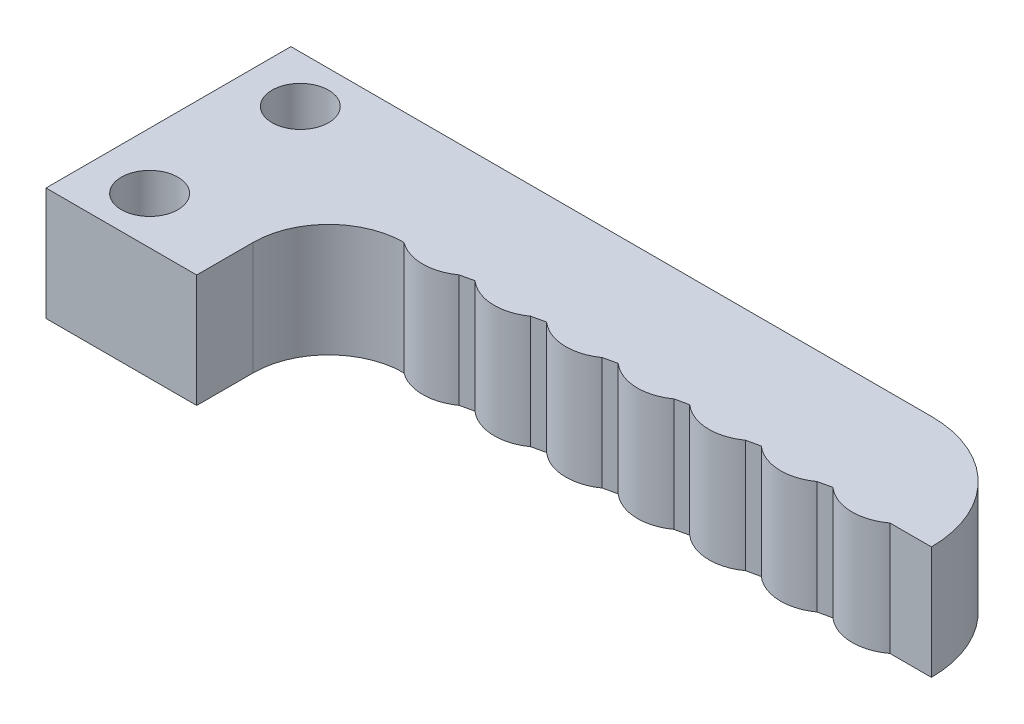
ISO-10303-21;
HEADER;
FILE_DESCRIPTION(('STEP AP214'),'2;1');
FILE_NAME('part.step','',(''),(''),'','','');
FILE_SCHEMA(('AUTOMOTIVE_DESIGN { 1 0 10303 214 1 1 1 1 }'));
ENDSEC;
DATA;
#1=APPLICATION_CONTEXT('core data for automotive mechanical design processes');
#2=APPLICATION_PROTOCOL_DEFINITION('international standard','automotive_design',2000,#1);
#3=PRODUCT_CONTEXT('',#1,'mechanical');
#4=PRODUCT('Part','Part','',(#3));
#5=PRODUCT_RELATED_PRODUCT_CATEGORY('part','',(#4));
#6=PRODUCT_DEFINITION_FORMATION('','',#4);
#7=PRODUCT_DEFINITION_CONTEXT('part definition',#1,'design');
#8=PRODUCT_DEFINITION('design','',#6,#7);
#9=PRODUCT_DEFINITION_SHAPE('','',#8);
#10=(LENGTH_UNIT() NAMED_UNIT(*) SI_UNIT(.MILLI.,.METRE.));
#11=(NAMED_UNIT(*) PLANE_ANGLE_UNIT() SI_UNIT($,.RADIAN.));
#12=(NAMED_UNIT(*) SI_UNIT($,.STERADIAN.) SOLID_ANGLE_UNIT());
#13=UNCERTAINTY_MEASURE_WITH_UNIT(LENGTH_MEASURE(1.E-05),#10,'distance_accuracy_value','');
#14=(GEOMETRIC_REPRESENTATION_CONTEXT(3) GLOBAL_UNCERTAINTY_ASSIGNED_CONTEXT((#13)) GLOBAL_UNIT_ASSIGNED_CONTEXT((#10,
#11,#12)) REPRESENTATION_CONTEXT('',''));
#15=CARTESIAN_POINT('',(0.,0.,0.));
#16=DIRECTION('',(0.,0.,1.));
#17=DIRECTION('',(1.,0.,0.));
#18=AXIS2_PLACEMENT_3D('',#15,#16,#17);
#19=CARTESIAN_POINT('',(14.,6.,-0.500000000000001));
#20=DIRECTION('',(0.,-1.,0.));
#21=DIRECTION('',(0.,0.,-1.));
#22=AXIS2_PLACEMENT_3D('',#19,#20,#21);
#23=CYLINDRICAL_SURFACE('',#22,6.);
#24=CARTESIAN_POINT('',(14.,0.,-0.500000000000001));
#25=DIRECTION('',(0.,-1.,0.));
#26=DIRECTION('',(0.,0.,-1.));
#27=AXIS2_PLACEMENT_3D('',#24,#25,#26);
#28=CIRCLE('',#27,6.);
#29=CARTESIAN_POINT('',(14.,0.,-6.5));
#30=VERTEX_POINT('',#29);
#31=CARTESIAN_POINT('',(20.,0.,-0.500000000000003));
#32=VERTEX_POINT('',#31);
#33=EDGE_CURVE('E236',#30,#32,#28,.T.);
#34=ORIENTED_EDGE('',*,*,#33,.F.);
#35=DIRECTION('',(0.,-1.,0.));
#36=VECTOR('',#35,1.);
#37=CARTESIAN_POINT('',(14.,6.,-6.5));
#38=LINE('',#37,#36);
#39=CARTESIAN_POINT('',(14.,6.,-6.5));
#40=VERTEX_POINT('',#39);
#41=EDGE_CURVE('E196',#40,#30,#38,.T.);
#42=ORIENTED_EDGE('',*,*,#41,.F.);
#43=CARTESIAN_POINT('',(14.,6.,-0.500000000000001));
#44=DIRECTION('',(0.,-1.,0.));
#45=DIRECTION('',(0.,0.,-1.));
#46=AXIS2_PLACEMENT_3D('',#43,#44,#45);
#47=CIRCLE('',#46,6.);
#48=CARTESIAN_POINT('',(20.,6.,-0.500000000000003));
#49=VERTEX_POINT('',#48);
#50=EDGE_CURVE('E191',#40,#49,#47,.T.);
#51=ORIENTED_EDGE('',*,*,#50,.T.);
#52=DIRECTION('',(0.,-1.,0.));
#53=VECTOR('',#52,1.);
#54=CARTESIAN_POINT('',(20.,6.,-0.500000000000003));
#55=LINE('',#54,#53);
#56=EDGE_CURVE('E174',#49,#32,#55,.T.);
#57=ORIENTED_EDGE('',*,*,#56,.T.);
#58=EDGE_LOOP('',(#34,#42,#51,#57));
#59=FACE_BOUND('',#58,.T.);
#60=ADVANCED_FACE('F35',(#59),#23,.T.);
#61=CARTESIAN_POINT('',(-20.,6.,-6.5));
#62=DIRECTION('',(0.,0.,-1.));
#63=DIRECTION('',(-1.,0.,0.));
#64=AXIS2_PLACEMENT_3D('',#61,#62,#63);
#65=PLANE('',#64);
#66=DIRECTION('',(1.,0.,0.));
#67=VECTOR('',#66,1.);
#68=CARTESIAN_POINT('',(-20.,0.,-6.5));
#69=LINE('',#68,#67);
#70=CARTESIAN_POINT('',(-20.,0.,-6.5));
#71=VERTEX_POINT('',#70);
#72=EDGE_CURVE('E197',#71,#30,#69,.T.);
#73=ORIENTED_EDGE('',*,*,#72,.F.);
#74=DIRECTION('',(0.,-1.,0.));
#75=VECTOR('',#74,1.);
#76=CARTESIAN_POINT('',(-20.,6.,-6.5));
#77=LINE('',#76,#75);
#78=CARTESIAN_POINT('',(-20.,6.,-6.5));
#79=VERTEX_POINT('',#78);
#80=EDGE_CURVE('E273',#79,#71,#77,.T.);
#81=ORIENTED_EDGE('',*,*,#80,.F.);
#82=DIRECTION('',(1.,0.,0.));
#83=VECTOR('',#82,1.);
#84=CARTESIAN_POINT('',(-20.,6.,-6.5));
#85=LINE('',#84,#83);
#86=EDGE_CURVE('E185',#79,#40,#85,.T.);
#87=ORIENTED_EDGE('',*,*,#86,.T.);
#88=ORIENTED_EDGE('',*,*,#41,.T.);
#89=EDGE_LOOP('',(#73,#81,#87,#88));
#90=FACE_BOUND('',#89,.T.);
#91=ADVANCED_FACE('F378',(#90),#65,.T.);
#92=CARTESIAN_POINT('',(-20.,6.,6.5));
#93=DIRECTION('',(-1.,0.,0.));
#94=DIRECTION('',(0.,0.,1.));
#95=AXIS2_PLACEMENT_3D('',#92,#93,#94);
#96=PLANE('',#95);
#97=DIRECTION('',(0.,0.,-1.));
#98=VECTOR('',#97,1.);
#99=CARTESIAN_POINT('',(-20.,0.,6.5));
#100=LINE('',#99,#98);
#101=CARTESIAN_POINT('',(-20.,0.,6.5));
#102=VERTEX_POINT('',#101);
#103=EDGE_CURVE('E200',#102,#71,#100,.T.);
#104=ORIENTED_EDGE('',*,*,#103,.F.);
#105=DIRECTION('',(0.,-1.,0.));
#106=VECTOR('',#105,1.);
#107=CARTESIAN_POINT('',(-20.,6.,6.5));
#108=LINE('',#107,#106);
#109=CARTESIAN_POINT('',(-20.,6.,6.5));
#110=VERTEX_POINT('',#109);
#111=EDGE_CURVE('E275',#110,#102,#108,.T.);
#112=ORIENTED_EDGE('',*,*,#111,.F.);
#113=DIRECTION('',(0.,0.,-1.));
#114=VECTOR('',#113,1.);
#115=CARTESIAN_POINT('',(-20.,6.,6.5));
#116=LINE('',#115,#114);
#117=EDGE_CURVE('E232',#110,#79,#116,.T.);
#118=ORIENTED_EDGE('',*,*,#117,.T.);
#119=ORIENTED_EDGE('',*,*,#80,.T.);
#120=EDGE_LOOP('',(#104,#112,#118,#119));
#121=FACE_BOUND('',#120,.T.);
#122=ADVANCED_FACE('F416',(#121),#96,.T.);
#123=CARTESIAN_POINT('',(-12.,6.,6.5));
#124=DIRECTION('',(0.,0.,1.));
#125=DIRECTION('',(1.,0.,0.));
#126=AXIS2_PLACEMENT_3D('',#123,#124,#125);
#127=PLANE('',#126);
#128=DIRECTION('',(-1.,0.,0.));
#129=VECTOR('',#128,1.);
#130=CARTESIAN_POINT('',(-12.,0.,6.5));
#131=LINE('',#130,#129);
#132=CARTESIAN_POINT('',(-12.,0.,6.5));
#133=VERTEX_POINT('',#132);
#134=EDGE_CURVE('E266',#133,#102,#131,.T.);
#135=ORIENTED_EDGE('',*,*,#134,.F.);
#136=DIRECTION('',(0.,-1.,0.));
#137=VECTOR('',#136,1.);
#138=CARTESIAN_POINT('',(-12.,6.,6.5));
#139=LINE('',#138,#137);
#140=CARTESIAN_POINT('',(-12.,6.,6.5));
#141=VERTEX_POINT('',#140);
#142=EDGE_CURVE('E277',#141,#133,#139,.T.);
#143=ORIENTED_EDGE('',*,*,#142,.F.);
#144=DIRECTION('',(-1.,0.,0.));
#145=VECTOR('',#144,1.);
#146=CARTESIAN_POINT('',(-12.,6.,6.5));
#147=LINE('',#146,#145);
#148=EDGE_CURVE('E229',#141,#110,#147,.T.);
#149=ORIENTED_EDGE('',*,*,#148,.T.);
#150=ORIENTED_EDGE('',*,*,#111,.T.);
#151=EDGE_LOOP('',(#135,#143,#149,#150));
#152=FACE_BOUND('',#151,.T.);
#153=ADVANCED_FACE('F385',(#152),#127,.T.);
#154=CARTESIAN_POINT('',(-12.,6.,3.5));
#155=DIRECTION('',(1.,0.,0.));
#156=DIRECTION('',(0.,0.,-1.));
#157=AXIS2_PLACEMENT_3D('',#154,#155,#156);
#158=PLANE('',#157);
#159=DIRECTION('',(0.,0.,1.));
#160=VECTOR('',#159,1.);
#161=CARTESIAN_POINT('',(-12.,0.,3.5));
#162=LINE('',#161,#160);
#163=CARTESIAN_POINT('',(-12.,0.,3.5));
#164=VERTEX_POINT('',#163);
#165=EDGE_CURVE('E263',#164,#133,#162,.T.);
#166=ORIENTED_EDGE('',*,*,#165,.F.);
#167=DIRECTION('',(0.,-1.,0.));
#168=VECTOR('',#167,1.);
#169=CARTESIAN_POINT('',(-12.,6.,3.5));
#170=LINE('',#169,#168);
#171=CARTESIAN_POINT('',(-12.,6.,3.5));
#172=VERTEX_POINT('',#171);
#173=EDGE_CURVE('E279',#172,#164,#170,.T.);
#174=ORIENTED_EDGE('',*,*,#173,.F.);
#175=DIRECTION('',(0.,0.,1.));
#176=VECTOR('',#175,1.);
#177=CARTESIAN_POINT('',(-12.,6.,3.5));
#178=LINE('',#177,#176);
#179=EDGE_CURVE('E226',#172,#141,#178,.T.);
#180=ORIENTED_EDGE('',*,*,#179,.T.);
#181=ORIENTED_EDGE('',*,*,#142,.T.);
#182=EDGE_LOOP('',(#166,#174,#180,#181));
#183=FACE_BOUND('',#182,.T.);
#184=ADVANCED_FACE('F388',(#183),#158,.T.);
#185=CARTESIAN_POINT('',(-8.,6.,3.5));
#186=DIRECTION('',(0.,-1.,0.));
#187=DIRECTION('',(0.,0.,-1.));
#188=AXIS2_PLACEMENT_3D('',#185,#186,#187);
#189=CYLINDRICAL_SURFACE('',#188,4.);
#190=CARTESIAN_POINT('',(-8.,0.,3.5));
#191=DIRECTION('',(0.,1.,0.));
#192=DIRECTION('',(0.,0.,1.));
#193=AXIS2_PLACEMENT_3D('',#190,#191,#192);
#194=CIRCLE('',#193,4.);
#195=CARTESIAN_POINT('',(-8.00000000000001,0.,-0.5));
#196=VERTEX_POINT('',#195);
#197=EDGE_CURVE('E260',#196,#164,#194,.T.);
#198=ORIENTED_EDGE('',*,*,#197,.F.);
#199=DIRECTION('',(0.,-1.,0.));
#200=VECTOR('',#199,1.);
#201=CARTESIAN_POINT('',(-8.00000000000001,6.,-0.5));
#202=LINE('',#201,#200);
#203=CARTESIAN_POINT('',(-8.00000000000001,6.,-0.5));
#204=VERTEX_POINT('',#203);
#205=EDGE_CURVE('E281',#204,#196,#202,.T.);
#206=ORIENTED_EDGE('',*,*,#205,.F.);
#207=CARTESIAN_POINT('',(-8.,6.,3.5));
#208=DIRECTION('',(0.,1.,0.));
#209=DIRECTION('',(0.,0.,1.));
#210=AXIS2_PLACEMENT_3D('',#207,#208,#209);
#211=CIRCLE('',#210,4.);
#212=EDGE_CURVE('E223',#204,#172,#211,.T.);
#213=ORIENTED_EDGE('',*,*,#212,.T.);
#214=ORIENTED_EDGE('',*,*,#173,.T.);
#215=EDGE_LOOP('',(#198,#206,#213,#214));
#216=FACE_BOUND('',#215,.T.);
#217=ADVANCED_FACE('F394',(#216),#189,.F.);
#218=CARTESIAN_POINT('',(-6.50000000000003,6.,-2.50000000000002));
#219=DIRECTION('',(0.,-1.,0.));
#220=DIRECTION('',(0.,0.,-1.));
#221=AXIS2_PLACEMENT_3D('',#218,#219,#220);
#222=CYLINDRICAL_SURFACE('',#221,2.50000000000001);
#223=CARTESIAN_POINT('',(-6.50000000000003,0.,-2.50000000000002));
#224=DIRECTION('',(0.,-1.,0.));
#225=DIRECTION('',(0.,0.,-1.));
#226=AXIS2_PLACEMENT_3D('',#223,#224,#225);
#227=CIRCLE('',#226,2.50000000000001);
#228=CARTESIAN_POINT('',(-5.0422733429896,0.,-0.468982276433528));
#229=VERTEX_POINT('',#228);
#230=EDGE_CURVE('E258',#229,#196,#227,.T.);
#231=ORIENTED_EDGE('',*,*,#230,.F.);
#232=DIRECTION('',(0.,-1.,0.));
#233=VECTOR('',#232,1.);
#234=CARTESIAN_POINT('',(-5.0422733429896,6.,-0.468982276433529));
#235=LINE('',#234,#233);
#236=CARTESIAN_POINT('',(-5.0422733429896,6.,-0.468982276433528));
#237=VERTEX_POINT('',#236);
#238=EDGE_CURVE('E307',#229,#237,#235,.F.);
#239=ORIENTED_EDGE('',*,*,#238,.T.);
#240=CARTESIAN_POINT('',(-6.50000000000003,6.,-2.50000000000002));
#241=DIRECTION('',(0.,-1.,0.));
#242=DIRECTION('',(0.,0.,-1.));
#243=AXIS2_PLACEMENT_3D('',#240,#241,#242);
#244=CIRCLE('',#243,2.50000000000001);
#245=EDGE_CURVE('E221',#237,#204,#244,.T.);
#246=ORIENTED_EDGE('',*,*,#245,.T.);
#247=ORIENTED_EDGE('',*,*,#205,.T.);
#248=EDGE_LOOP('',(#231,#239,#246,#247));
#249=FACE_BOUND('',#248,.T.);
#250=ADVANCED_FACE('F397',(#249),#222,.T.);
#251=CARTESIAN_POINT('',(-2.70000000000003,6.,-2.50000000000004));
#252=DIRECTION('',(0.,-1.,0.));
#253=DIRECTION('',(0.,0.,-1.));
#254=AXIS2_PLACEMENT_3D('',#251,#252,#253);
#255=CYLINDRICAL_SURFACE('',#254,2.5);
#256=CARTESIAN_POINT('',(-2.70000000000003,6.,-2.50000000000004));
#257=DIRECTION('',(0.,-1.,0.));
#258=DIRECTION('',(0.,0.,-1.));
#259=AXIS2_PLACEMENT_3D('',#256,#257,#258);
#260=CIRCLE('',#259,2.5);
#261=CARTESIAN_POINT('',(-1.2422733429896,6.,-0.468982276433551));
#262=VERTEX_POINT('',#261);
#263=CARTESIAN_POINT('',(-4.35164629120996,6.,-0.623283577965927));
#264=VERTEX_POINT('',#263);
#265=EDGE_CURVE('E218',#262,#264,#260,.T.);
#266=ORIENTED_EDGE('',*,*,#265,.T.);
#267=DIRECTION('',(0.,-1.,0.));
#268=VECTOR('',#267,1.);
#269=CARTESIAN_POINT('',(-4.35164629120996,6.,-0.623283577965928));
#270=LINE('',#269,#268);
#271=CARTESIAN_POINT('',(-4.35164629120996,0.,-0.62328357796593));
#272=VERTEX_POINT('',#271);
#273=EDGE_CURVE('E304',#264,#272,#270,.T.);
#274=ORIENTED_EDGE('',*,*,#273,.T.);
#275=CARTESIAN_POINT('',(-2.70000000000003,0.,-2.50000000000004));
#276=DIRECTION('',(0.,-1.,0.));
#277=DIRECTION('',(0.,0.,-1.));
#278=AXIS2_PLACEMENT_3D('',#275,#276,#277);
#279=CIRCLE('',#278,2.5);
#280=CARTESIAN_POINT('',(-1.2422733429896,0.,-0.468982276433551));
#281=VERTEX_POINT('',#280);
#282=EDGE_CURVE('E255',#281,#272,#279,.T.);
#283=ORIENTED_EDGE('',*,*,#282,.F.);
#284=DIRECTION('',(0.,-1.,0.));
#285=VECTOR('',#284,1.);
#286=CARTESIAN_POINT('',(-1.2422733429896,6.,-0.468982276433552));
#287=LINE('',#286,#285);
#288=EDGE_CURVE('E302',#281,#262,#287,.F.);
#289=ORIENTED_EDGE('',*,*,#288,.T.);
#290=EDGE_LOOP('',(#266,#274,#283,#289));
#291=FACE_BOUND('',#290,.T.);
#292=ADVANCED_FACE('F339',(#291),#255,.T.);
#293=CARTESIAN_POINT('',(1.09999999999997,6.,-2.50000000000006));
#294=DIRECTION('',(0.,-1.,0.));
#295=DIRECTION('',(0.,0.,-1.));
#296=AXIS2_PLACEMENT_3D('',#293,#294,#295);
#297=CYLINDRICAL_SURFACE('',#296,2.5);
#298=CARTESIAN_POINT('',(1.09999999999997,0.,-2.50000000000006));
#299=DIRECTION('',(0.,-1.,0.));
#300=DIRECTION('',(0.,0.,-1.));
#301=AXIS2_PLACEMENT_3D('',#298,#299,#300);
#302=CIRCLE('',#301,2.5);
#303=CARTESIAN_POINT('',(2.55772665701041,0.,-0.468982276433582));
#304=VERTEX_POINT('',#303);
#305=CARTESIAN_POINT('',(-0.551646291209957,0.,-0.623283577965954));
#306=VERTEX_POINT('',#305);
#307=EDGE_CURVE('E252',#304,#306,#302,.T.);
#308=ORIENTED_EDGE('',*,*,#307,.F.);
#309=DIRECTION('',(0.,-1.,0.));
#310=VECTOR('',#309,1.);
#311=CARTESIAN_POINT('',(2.55772665701041,6.,-0.468982276433583));
#312=LINE('',#311,#310);
#313=CARTESIAN_POINT('',(2.55772665701041,6.,-0.468982276433582));
#314=VERTEX_POINT('',#313);
#315=EDGE_CURVE('E300',#304,#314,#312,.F.);
#316=ORIENTED_EDGE('',*,*,#315,.T.);
#317=CARTESIAN_POINT('',(1.09999999999997,6.,-2.50000000000006));
#318=DIRECTION('',(0.,-1.,0.));
#319=DIRECTION('',(0.,0.,-1.));
#320=AXIS2_PLACEMENT_3D('',#317,#318,#319);
#321=CIRCLE('',#320,2.5);
#322=CARTESIAN_POINT('',(-0.551646291209955,6.,-0.623283577965952));
#323=VERTEX_POINT('',#322);
#324=EDGE_CURVE('E215',#314,#323,#321,.T.);
#325=ORIENTED_EDGE('',*,*,#324,.T.);
#326=DIRECTION('',(0.,-1.,0.));
#327=VECTOR('',#326,1.);
#328=CARTESIAN_POINT('',(-0.551646291209955,6.,-0.623283577965952));
#329=LINE('',#328,#327);
#330=EDGE_CURVE('E297',#323,#306,#329,.T.);
#331=ORIENTED_EDGE('',*,*,#330,.T.);
#332=EDGE_LOOP('',(#308,#316,#325,#331));
#333=FACE_BOUND('',#332,.T.);
#334=ADVANCED_FACE('F346',(#333),#297,.T.);
#335=CARTESIAN_POINT('',(4.89999999999997,6.,-2.50000000000009));
#336=DIRECTION('',(0.,-1.,0.));
#337=DIRECTION('',(0.,0.,-1.));
#338=AXIS2_PLACEMENT_3D('',#335,#336,#337);
#339=CYLINDRICAL_SURFACE('',#338,2.5);
#340=CARTESIAN_POINT('',(4.89999999999997,6.,-2.50000000000009));
#341=DIRECTION('',(0.,-1.,0.));
#342=DIRECTION('',(0.,0.,-1.));
#343=AXIS2_PLACEMENT_3D('',#340,#341,#342);
#344=CIRCLE('',#343,2.5);
#345=CARTESIAN_POINT('',(6.35772665701041,6.,-0.46898227643361));
#346=VERTEX_POINT('',#345);
#347=CARTESIAN_POINT('',(3.24835370879004,6.,-0.623283577965983));
#348=VERTEX_POINT('',#347);
#349=EDGE_CURVE('E212',#346,#348,#344,.T.);
#350=ORIENTED_EDGE('',*,*,#349,.T.);
#351=DIRECTION('',(0.,-1.,0.));
#352=VECTOR('',#351,1.);
#353=CARTESIAN_POINT('',(3.24835370879004,6.,-0.623283577965984));
#354=LINE('',#353,#352);
#355=CARTESIAN_POINT('',(3.24835370879003,0.,-0.623283577965985));
#356=VERTEX_POINT('',#355);
#357=EDGE_CURVE('E294',#348,#356,#354,.T.);
#358=ORIENTED_EDGE('',*,*,#357,.T.);
#359=CARTESIAN_POINT('',(4.89999999999997,0.,-2.50000000000009));
#360=DIRECTION('',(0.,-1.,0.));
#361=DIRECTION('',(0.,0.,-1.));
#362=AXIS2_PLACEMENT_3D('',#359,#360,#361);
#363=CIRCLE('',#362,2.5);
#364=CARTESIAN_POINT('',(6.35772665701041,0.,-0.46898227643361));
#365=VERTEX_POINT('',#364);
#366=EDGE_CURVE('E249',#365,#356,#363,.T.);
#367=ORIENTED_EDGE('',*,*,#366,.F.);
#368=DIRECTION('',(0.,-1.,0.));
#369=VECTOR('',#368,1.);
#370=CARTESIAN_POINT('',(6.35772665701041,6.,-0.468982276433611));
#371=LINE('',#370,#369);
#372=EDGE_CURVE('E292',#365,#346,#371,.F.);
#373=ORIENTED_EDGE('',*,*,#372,.T.);
#374=EDGE_LOOP('',(#350,#358,#367,#373));
#375=FACE_BOUND('',#374,.T.);
#376=ADVANCED_FACE('F352',(#375),#339,.T.);
#377=CARTESIAN_POINT('',(8.69999999999997,6.,-2.50000000000012));
#378=DIRECTION('',(0.,-1.,0.));
#379=DIRECTION('',(0.,0.,-1.));
#380=AXIS2_PLACEMENT_3D('',#377,#378,#379);
#381=CYLINDRICAL_SURFACE('',#380,2.5);
#382=CARTESIAN_POINT('',(8.69999999999997,0.,-2.50000000000012));
#383=DIRECTION('',(0.,-1.,0.));
#384=DIRECTION('',(0.,0.,-1.));
#385=AXIS2_PLACEMENT_3D('',#382,#383,#384);
#386=CIRCLE('',#385,2.5);
#387=CARTESIAN_POINT('',(10.1577266570104,0.,-0.468982276433635));
#388=VERTEX_POINT('',#387);
#389=CARTESIAN_POINT('',(7.04835370879004,0.,-0.623283577966012));
#390=VERTEX_POINT('',#389);
#391=EDGE_CURVE('E246',#388,#390,#386,.T.);
#392=ORIENTED_EDGE('',*,*,#391,.F.);
#393=DIRECTION('',(0.,-1.,0.));
#394=VECTOR('',#393,1.);
#395=CARTESIAN_POINT('',(10.1577266570104,6.,-0.468982276433635));
#396=LINE('',#395,#394);
#397=CARTESIAN_POINT('',(10.1577266570104,6.,-0.468982276433635));
#398=VERTEX_POINT('',#397);
#399=EDGE_CURVE('E58',#388,#398,#396,.F.);
#400=ORIENTED_EDGE('',*,*,#399,.T.);
#401=CARTESIAN_POINT('',(8.69999999999997,6.,-2.50000000000012));
#402=DIRECTION('',(0.,-1.,0.));
#403=DIRECTION('',(0.,0.,-1.));
#404=AXIS2_PLACEMENT_3D('',#401,#402,#403);
#405=CIRCLE('',#404,2.5);
#406=CARTESIAN_POINT('',(7.04835370879004,6.,-0.62328357796601));
#407=VERTEX_POINT('',#406);
#408=EDGE_CURVE('E210',#398,#407,#405,.T.);
#409=ORIENTED_EDGE('',*,*,#408,.T.);
#410=DIRECTION('',(0.,-1.,0.));
#411=VECTOR('',#410,1.);
#412=CARTESIAN_POINT('',(7.04835370879004,6.,-0.62328357796601));
#413=LINE('',#412,#411);
#414=EDGE_CURVE('E309',#407,#390,#413,.T.);
#415=ORIENTED_EDGE('',*,*,#414,.T.);
#416=EDGE_LOOP('',(#392,#400,#409,#415));
#417=FACE_BOUND('',#416,.T.);
#418=ADVANCED_FACE('F358',(#417),#381,.T.);
#419=CARTESIAN_POINT('',(12.5,6.,-2.50000000000015));
#420=DIRECTION('',(0.,-1.,0.));
#421=DIRECTION('',(0.,0.,-1.));
#422=AXIS2_PLACEMENT_3D('',#419,#420,#421);
#423=CYLINDRICAL_SURFACE('',#422,2.5);
#424=CARTESIAN_POINT('',(12.5,0.,-2.50000000000015));
#425=DIRECTION('',(0.,-1.,0.));
#426=DIRECTION('',(0.,0.,-1.));
#427=AXIS2_PLACEMENT_3D('',#424,#425,#426);
#428=CIRCLE('',#427,2.5);
#429=CARTESIAN_POINT('',(13.9577266570104,0.,-0.468982276433666));
#430=VERTEX_POINT('',#429);
#431=CARTESIAN_POINT('',(10.84835370879,0.,-0.623283577966035));
#432=VERTEX_POINT('',#431);
#433=EDGE_CURVE('E243',#430,#432,#428,.T.);
#434=ORIENTED_EDGE('',*,*,#433,.F.);
#435=DIRECTION('',(0.,-1.,0.));
#436=VECTOR('',#435,1.);
#437=CARTESIAN_POINT('',(13.9577266570104,6.,-0.468982276433666));
#438=LINE('',#437,#436);
#439=CARTESIAN_POINT('',(13.9577266570104,6.,-0.468982276433666));
#440=VERTEX_POINT('',#439);
#441=EDGE_CURVE('E290',#430,#440,#438,.F.);
#442=ORIENTED_EDGE('',*,*,#441,.T.);
#443=CARTESIAN_POINT('',(12.5,6.,-2.50000000000015));
#444=DIRECTION('',(0.,-1.,0.));
#445=DIRECTION('',(0.,0.,-1.));
#446=AXIS2_PLACEMENT_3D('',#443,#444,#445);
#447=CIRCLE('',#446,2.5);
#448=CARTESIAN_POINT('',(10.84835370879,6.,-0.623283577966034));
#449=VERTEX_POINT('',#448);
#450=EDGE_CURVE('E207',#440,#449,#447,.T.);
#451=ORIENTED_EDGE('',*,*,#450,.T.);
#452=DIRECTION('',(0.,-1.,0.));
#453=VECTOR('',#452,1.);
#454=CARTESIAN_POINT('',(10.84835370879,6.,-0.623283577966033));
#455=LINE('',#454,#453);
#456=EDGE_CURVE('E287',#449,#432,#455,.T.);
#457=ORIENTED_EDGE('',*,*,#456,.T.);
#458=EDGE_LOOP('',(#434,#442,#451,#457));
#459=FACE_BOUND('',#458,.T.);
#460=ADVANCED_FACE('F365',(#459),#423,.T.);
#461=CARTESIAN_POINT('',(16.3,6.,-2.50000000000018));
#462=DIRECTION('',(0.,-1.,0.));
#463=DIRECTION('',(0.,0.,-1.));
#464=AXIS2_PLACEMENT_3D('',#461,#462,#463);
#465=CYLINDRICAL_SURFACE('',#464,2.50000000000003);
#466=CARTESIAN_POINT('',(16.3,6.,-2.50000000000018));
#467=DIRECTION('',(0.,-1.,0.));
#468=DIRECTION('',(0.,0.,-1.));
#469=AXIS2_PLACEMENT_3D('',#466,#467,#468);
#470=CIRCLE('',#469,2.50000000000003);
#471=CARTESIAN_POINT('',(17.7999999999998,6.,-0.500000000000027));
#472=VERTEX_POINT('',#471);
#473=CARTESIAN_POINT('',(14.64835370879,6.,-0.623283577966059));
#474=VERTEX_POINT('',#473);
#475=EDGE_CURVE('E194',#472,#474,#470,.T.);
#476=ORIENTED_EDGE('',*,*,#475,.T.);
#477=DIRECTION('',(0.,-1.,0.));
#478=VECTOR('',#477,1.);
#479=CARTESIAN_POINT('',(14.64835370879,6.,-0.623283577966059));
#480=LINE('',#479,#478);
#481=CARTESIAN_POINT('',(14.64835370879,0.,-0.623283577966061));
#482=VERTEX_POINT('',#481);
#483=EDGE_CURVE('E272',#474,#482,#480,.T.);
#484=ORIENTED_EDGE('',*,*,#483,.T.);
#485=CARTESIAN_POINT('',(16.3,0.,-2.50000000000018));
#486=DIRECTION('',(0.,-1.,0.));
#487=DIRECTION('',(0.,0.,-1.));
#488=AXIS2_PLACEMENT_3D('',#485,#486,#487);
#489=CIRCLE('',#488,2.50000000000003);
#490=CARTESIAN_POINT('',(17.7999999999998,0.,-0.500000000000027));
#491=VERTEX_POINT('',#490);
#492=EDGE_CURVE('E240',#491,#482,#489,.T.);
#493=ORIENTED_EDGE('',*,*,#492,.F.);
#494=DIRECTION('',(0.,-1.,0.));
#495=VECTOR('',#494,1.);
#496=CARTESIAN_POINT('',(17.7999999999998,6.,-0.500000000000027));
#497=LINE('',#496,#495);
#498=EDGE_CURVE('E184',#472,#491,#497,.T.);
#499=ORIENTED_EDGE('',*,*,#498,.F.);
#500=EDGE_LOOP('',(#476,#484,#493,#499));
#501=FACE_BOUND('',#500,.T.);
#502=ADVANCED_FACE('F374',(#501),#465,.T.);
#503=CARTESIAN_POINT('',(20.,6.,-0.500000000000003));
#504=DIRECTION('',(0.,0.,1.));
#505=DIRECTION('',(1.,0.,0.));
#506=AXIS2_PLACEMENT_3D('',#503,#504,#505);
#507=PLANE('',#506);
#508=DIRECTION('',(-1.,0.,0.));
#509=VECTOR('',#508,1.);
#510=CARTESIAN_POINT('',(20.,0.,-0.500000000000003));
#511=LINE('',#510,#509);
#512=EDGE_CURVE('E179',#32,#491,#511,.T.);
#513=ORIENTED_EDGE('',*,*,#512,.F.);
#514=ORIENTED_EDGE('',*,*,#56,.F.);
#515=DIRECTION('',(-1.,0.,0.));
#516=VECTOR('',#515,1.);
#517=CARTESIAN_POINT('',(20.,6.,-0.500000000000003));
#518=LINE('',#517,#516);
#519=EDGE_CURVE('E177',#49,#472,#518,.T.);
#520=ORIENTED_EDGE('',*,*,#519,.T.);
#521=ORIENTED_EDGE('',*,*,#498,.T.);
#522=EDGE_LOOP('',(#513,#514,#520,#521));
#523=FACE_BOUND('',#522,.T.);
#524=ADVANCED_FACE('F176',(#523),#507,.T.);
#525=CARTESIAN_POINT('',(14.,6.,-0.500000000000001));
#526=DIRECTION('',(0.,-1.,0.));
#527=DIRECTION('',(0.,0.,-1.));
#528=AXIS2_PLACEMENT_3D('',#525,#526,#527);
#529=PLANE('',#528);
#530=CARTESIAN_POINT('',(-17.,6.,-4.));
#531=DIRECTION('',(0.,1.,0.));
#532=DIRECTION('',(0.,0.,1.));
#533=AXIS2_PLACEMENT_3D('',#530,#531,#532);
#534=CIRCLE('',#533,1.5);
#535=CARTESIAN_POINT('',(-17.,6.,-2.5));
#536=VERTEX_POINT('',#535);
#537=EDGE_CURVE('E623',#536,#536,#534,.T.);
#538=ORIENTED_EDGE('',*,*,#537,.F.);
#539=EDGE_LOOP('',(#538));
#540=FACE_BOUND('',#539,.T.);
#541=CARTESIAN_POINT('',(-17.,6.,4.));
#542=DIRECTION('',(0.,1.,0.));
#543=DIRECTION('',(0.,0.,1.));
#544=AXIS2_PLACEMENT_3D('',#541,#542,#543);
#545=CIRCLE('',#544,1.5);
#546=CARTESIAN_POINT('',(-17.,6.,5.5));
#547=VERTEX_POINT('',#546);
#548=EDGE_CURVE('E203',#547,#547,#545,.T.);
#549=ORIENTED_EDGE('',*,*,#548,.F.);
#550=EDGE_LOOP('',(#549));
#551=FACE_BOUND('',#550,.T.);
#552=ORIENTED_EDGE('',*,*,#50,.F.);
#553=ORIENTED_EDGE('',*,*,#86,.F.);
#554=ORIENTED_EDGE('',*,*,#117,.F.);
#555=ORIENTED_EDGE('',*,*,#148,.F.);
#556=ORIENTED_EDGE('',*,*,#179,.F.);
#557=ORIENTED_EDGE('',*,*,#212,.F.);
#558=ORIENTED_EDGE('',*,*,#245,.F.);
#559=DIRECTION('',(-0.9759384578967,0.,0.218046156577479));
#560=VECTOR('',#559,1.);
#561=CARTESIAN_POINT('',(13.1012523093638,6.,-4.52264570495199));
#562=LINE('',#561,#560);
#563=EDGE_CURVE('E323',#237,#264,#562,.F.);
#564=ORIENTED_EDGE('',*,*,#563,.T.);
#565=ORIENTED_EDGE('',*,*,#265,.F.);
#566=DIRECTION('',(-0.9759384578967,0.,0.218046156577479));
#567=VECTOR('',#566,1.);
#568=CARTESIAN_POINT('',(13.281919989677,6.,-3.71400711171001));
#569=LINE('',#568,#567);
#570=EDGE_CURVE('E11',#262,#323,#569,.F.);
#571=ORIENTED_EDGE('',*,*,#570,.T.);
#572=ORIENTED_EDGE('',*,*,#324,.F.);
#573=DIRECTION('',(-0.975938457896699,0.,0.218046156577484));
#574=VECTOR('',#573,1.);
#575=CARTESIAN_POINT('',(13.4625876699902,6.,-2.90536851846809));
#576=LINE('',#575,#574);
#577=EDGE_CURVE('E319',#314,#348,#576,.F.);
#578=ORIENTED_EDGE('',*,*,#577,.T.);
#579=ORIENTED_EDGE('',*,*,#349,.F.);
#580=DIRECTION('',(-0.9759384578967,0.,0.218046156577483));
#581=VECTOR('',#580,1.);
#582=CARTESIAN_POINT('',(13.6432553503034,6.,-2.09672992522609));
#583=LINE('',#582,#581);
#584=EDGE_CURVE('E51',#346,#407,#583,.F.);
#585=ORIENTED_EDGE('',*,*,#584,.T.);
#586=ORIENTED_EDGE('',*,*,#408,.F.);
#587=DIRECTION('',(-0.9759384578967,0.,0.218046156577481));
#588=VECTOR('',#587,1.);
#589=CARTESIAN_POINT('',(13.8239230306166,6.,-1.28809133198408));
#590=LINE('',#589,#588);
#591=EDGE_CURVE('E327',#398,#449,#590,.F.);
#592=ORIENTED_EDGE('',*,*,#591,.T.);
#593=ORIENTED_EDGE('',*,*,#450,.F.);
#594=DIRECTION('',(-0.975938457896699,0.,0.218046156577485));
#595=VECTOR('',#594,1.);
#596=CARTESIAN_POINT('',(14.0045907109298,6.,-0.479452738742103));
#597=LINE('',#596,#595);
#598=EDGE_CURVE('E315',#440,#474,#597,.F.);
#599=ORIENTED_EDGE('',*,*,#598,.T.);
#600=ORIENTED_EDGE('',*,*,#475,.F.);
#601=ORIENTED_EDGE('',*,*,#519,.F.);
#602=EDGE_LOOP('',(#552,#553,#554,#555,#556,#557,#558,#564,#565,#571,#572,#578,#579,#585,#586,
#592,#593,#599,#600,#601));
#603=FACE_BOUND('',#602,.T.);
#604=ADVANCED_FACE('F189',(#540,#551,#603),#529,.F.);
#605=CARTESIAN_POINT('',(14.,0.,-0.500000000000001));
#606=DIRECTION('',(0.,-1.,0.));
#607=DIRECTION('',(0.,0.,-1.));
#608=AXIS2_PLACEMENT_3D('',#605,#606,#607);
#609=PLANE('',#608);
#610=CARTESIAN_POINT('',(-17.,0.,-4.));
#611=DIRECTION('',(0.,1.,0.));
#612=DIRECTION('',(0.,0.,1.));
#613=AXIS2_PLACEMENT_3D('',#610,#611,#612);
#614=CIRCLE('',#613,1.5);
#615=CARTESIAN_POINT('',(-17.,0.,-2.5));
#616=VERTEX_POINT('',#615);
#617=EDGE_CURVE('E238',#616,#616,#614,.T.);
#618=ORIENTED_EDGE('',*,*,#617,.T.);
#619=EDGE_LOOP('',(#618));
#620=FACE_BOUND('',#619,.T.);
#621=CARTESIAN_POINT('',(-17.,0.,4.));
#622=DIRECTION('',(0.,1.,0.));
#623=DIRECTION('',(0.,0.,1.));
#624=AXIS2_PLACEMENT_3D('',#621,#622,#623);
#625=CIRCLE('',#624,1.5);
#626=CARTESIAN_POINT('',(-17.,0.,5.5));
#627=VERTEX_POINT('',#626);
#628=EDGE_CURVE('E622',#627,#627,#625,.T.);
#629=ORIENTED_EDGE('',*,*,#628,.T.);
#630=EDGE_LOOP('',(#629));
#631=FACE_BOUND('',#630,.T.);
#632=ORIENTED_EDGE('',*,*,#33,.T.);
#633=ORIENTED_EDGE('',*,*,#512,.T.);
#634=ORIENTED_EDGE('',*,*,#492,.T.);
#635=DIRECTION('',(0.975938457896699,0.,-0.218046156577485));
#636=VECTOR('',#635,1.);
#637=CARTESIAN_POINT('',(14.64835370879,0.,-0.623283577966061));
#638=LINE('',#637,#636);
#639=EDGE_CURVE('E313',#482,#430,#638,.F.);
#640=ORIENTED_EDGE('',*,*,#639,.T.);
#641=ORIENTED_EDGE('',*,*,#433,.T.);
#642=DIRECTION('',(0.9759384578967,0.,-0.218046156577481));
#643=VECTOR('',#642,1.);
#644=CARTESIAN_POINT('',(10.84835370879,0.,-0.623283577966036));
#645=LINE('',#644,#643);
#646=EDGE_CURVE('E325',#432,#388,#645,.F.);
#647=ORIENTED_EDGE('',*,*,#646,.T.);
#648=ORIENTED_EDGE('',*,*,#391,.T.);
#649=DIRECTION('',(0.9759384578967,0.,-0.218046156577483));
#650=VECTOR('',#649,1.);
#651=CARTESIAN_POINT('',(7.04835370879004,0.,-0.623283577966012));
#652=LINE('',#651,#650);
#653=EDGE_CURVE('E329',#390,#365,#652,.F.);
#654=ORIENTED_EDGE('',*,*,#653,.T.);
#655=ORIENTED_EDGE('',*,*,#366,.T.);
#656=DIRECTION('',(0.975938457896699,0.,-0.218046156577484));
#657=VECTOR('',#656,1.);
#658=CARTESIAN_POINT('',(3.24835370879004,0.,-0.623283577965985));
#659=LINE('',#658,#657);
#660=EDGE_CURVE('E317',#356,#304,#659,.F.);
#661=ORIENTED_EDGE('',*,*,#660,.T.);
#662=ORIENTED_EDGE('',*,*,#307,.T.);
#663=DIRECTION('',(0.9759384578967,0.,-0.218046156577479));
#664=VECTOR('',#663,1.);
#665=CARTESIAN_POINT('',(-0.551646291209957,0.,-0.623283577965953));
#666=LINE('',#665,#664);
#667=EDGE_CURVE('E44',#306,#281,#666,.F.);
#668=ORIENTED_EDGE('',*,*,#667,.T.);
#669=ORIENTED_EDGE('',*,*,#282,.T.);
#670=DIRECTION('',(0.9759384578967,0.,-0.218046156577479));
#671=VECTOR('',#670,1.);
#672=CARTESIAN_POINT('',(-4.35164629120996,0.,-0.62328357796593));
#673=LINE('',#672,#671);
#674=EDGE_CURVE('E321',#272,#229,#673,.F.);
#675=ORIENTED_EDGE('',*,*,#674,.T.);
#676=ORIENTED_EDGE('',*,*,#230,.T.);
#677=ORIENTED_EDGE('',*,*,#197,.T.);
#678=ORIENTED_EDGE('',*,*,#165,.T.);
#679=ORIENTED_EDGE('',*,*,#134,.T.);
#680=ORIENTED_EDGE('',*,*,#103,.T.);
#681=ORIENTED_EDGE('',*,*,#72,.T.);
#682=EDGE_LOOP('',(#632,#633,#634,#640,#641,#647,#648,#654,#655,#661,#662,#668,#669,#675,#676,
#677,#678,#679,#680,#681));
#683=FACE_BOUND('',#682,.T.);
#684=ADVANCED_FACE('F333',(#620,#631,#683),#609,.T.);
#685=CARTESIAN_POINT('',(14.64835370879,6.,-0.623283577966061));
#686=DIRECTION('',(0.218046156577485,0.,0.975938457896699));
#687=DIRECTION('',(0.,1.,0.));
#688=AXIS2_PLACEMENT_3D('',#685,#686,#687);
#689=PLANE('',#688);
#690=ORIENTED_EDGE('',*,*,#598,.F.);
#691=ORIENTED_EDGE('',*,*,#441,.F.);
#692=ORIENTED_EDGE('',*,*,#639,.F.);
#693=ORIENTED_EDGE('',*,*,#483,.F.);
#694=EDGE_LOOP('',(#690,#691,#692,#693));
#695=FACE_BOUND('',#694,.T.);
#696=ADVANCED_FACE('F371',(#695),#689,.T.);
#697=CARTESIAN_POINT('',(3.24835370879004,6.,-0.623283577965985));
#698=DIRECTION('',(0.218046156577484,0.,0.975938457896699));
#699=DIRECTION('',(0.,1.,0.));
#700=AXIS2_PLACEMENT_3D('',#697,#698,#699);
#701=PLANE('',#700);
#702=ORIENTED_EDGE('',*,*,#577,.F.);
#703=ORIENTED_EDGE('',*,*,#315,.F.);
#704=ORIENTED_EDGE('',*,*,#660,.F.);
#705=ORIENTED_EDGE('',*,*,#357,.F.);
#706=EDGE_LOOP('',(#702,#703,#704,#705));
#707=FACE_BOUND('',#706,.T.);
#708=ADVANCED_FACE('F349',(#707),#701,.T.);
#709=CARTESIAN_POINT('',(-4.35164629120996,6.,-0.62328357796593));
#710=DIRECTION('',(0.218046156577479,0.,0.9759384578967));
#711=DIRECTION('',(0.,1.,0.));
#712=AXIS2_PLACEMENT_3D('',#709,#710,#711);
#713=PLANE('',#712);
#714=ORIENTED_EDGE('',*,*,#563,.F.);
#715=ORIENTED_EDGE('',*,*,#238,.F.);
#716=ORIENTED_EDGE('',*,*,#674,.F.);
#717=ORIENTED_EDGE('',*,*,#273,.F.);
#718=EDGE_LOOP('',(#714,#715,#716,#717));
#719=FACE_BOUND('',#718,.T.);
#720=ADVANCED_FACE('F401',(#719),#713,.T.);
#721=CARTESIAN_POINT('',(10.84835370879,6.,-0.623283577966036));
#722=DIRECTION('',(0.218046156577481,0.,0.9759384578967));
#723=DIRECTION('',(0.,1.,0.));
#724=AXIS2_PLACEMENT_3D('',#721,#722,#723);
#725=PLANE('',#724);
#726=ORIENTED_EDGE('',*,*,#591,.F.);
#727=ORIENTED_EDGE('',*,*,#399,.F.);
#728=ORIENTED_EDGE('',*,*,#646,.F.);
#729=ORIENTED_EDGE('',*,*,#456,.F.);
#730=EDGE_LOOP('',(#726,#727,#728,#729));
#731=FACE_BOUND('',#730,.T.);
#732=ADVANCED_FACE('F363',(#731),#725,.T.);
#733=CARTESIAN_POINT('',(7.04835370879004,6.,-0.623283577966012));
#734=DIRECTION('',(0.218046156577483,0.,0.975938457896699));
#735=DIRECTION('',(0.,1.,0.));
#736=AXIS2_PLACEMENT_3D('',#733,#734,#735);
#737=PLANE('',#736);
#738=ORIENTED_EDGE('',*,*,#584,.F.);
#739=ORIENTED_EDGE('',*,*,#372,.F.);
#740=ORIENTED_EDGE('',*,*,#653,.F.);
#741=ORIENTED_EDGE('',*,*,#414,.F.);
#742=EDGE_LOOP('',(#738,#739,#740,#741));
#743=FACE_BOUND('',#742,.T.);
#744=ADVANCED_FACE('F356',(#743),#737,.T.);
#745=CARTESIAN_POINT('',(-0.551646291209957,6.,-0.623283577965953));
#746=DIRECTION('',(0.218046156577479,0.,0.9759384578967));
#747=DIRECTION('',(0.,1.,0.));
#748=AXIS2_PLACEMENT_3D('',#745,#746,#747);
#749=PLANE('',#748);
#750=ORIENTED_EDGE('',*,*,#570,.F.);
#751=ORIENTED_EDGE('',*,*,#288,.F.);
#752=ORIENTED_EDGE('',*,*,#667,.F.);
#753=ORIENTED_EDGE('',*,*,#330,.F.);
#754=EDGE_LOOP('',(#750,#751,#752,#753));
#755=FACE_BOUND('',#754,.T.);
#756=ADVANCED_FACE('F38',(#755),#749,.T.);
#757=CARTESIAN_POINT('',(-17.,0.,4.));
#758=DIRECTION('',(0.,1.,0.));
#759=DIRECTION('',(0.,0.,1.));
#760=AXIS2_PLACEMENT_3D('',#757,#758,#759);
#761=CYLINDRICAL_SURFACE('',#760,1.5);
#762=CARTESIAN_POINT('',(-17.,0.,5.5));
#763=CARTESIAN_POINT('',(-17.,0.0624999999999999,5.5));
#764=CARTESIAN_POINT('',(-17.,0.125,5.5));
#765=CARTESIAN_POINT('',(-17.,0.25,5.5));
#766=CARTESIAN_POINT('',(-17.,0.3125,5.5));
#767=CARTESIAN_POINT('',(-17.,0.4375,5.5));
#768=CARTESIAN_POINT('',(-17.,0.5,5.5));
#769=CARTESIAN_POINT('',(-17.,0.625,5.5));
#770=CARTESIAN_POINT('',(-17.,0.6875,5.5));
#771=CARTESIAN_POINT('',(-17.,0.8125,5.5));
#772=CARTESIAN_POINT('',(-17.,0.875,5.5));
#773=CARTESIAN_POINT('',(-17.,1.,5.5));
#774=CARTESIAN_POINT('',(-17.,1.0625,5.5));
#775=CARTESIAN_POINT('',(-17.,1.1875,5.5));
#776=CARTESIAN_POINT('',(-17.,1.25,5.5));
#777=CARTESIAN_POINT('',(-17.,1.375,5.5));
#778=CARTESIAN_POINT('',(-17.,1.4375,5.5));
#779=CARTESIAN_POINT('',(-17.,1.5625,5.5));
#780=CARTESIAN_POINT('',(-17.,1.625,5.5));
#781=CARTESIAN_POINT('',(-17.,1.75,5.5));
#782=CARTESIAN_POINT('',(-17.,1.8125,5.5));
#783=CARTESIAN_POINT('',(-17.,1.9375,5.5));
#784=CARTESIAN_POINT('',(-17.,2.,5.5));
#785=CARTESIAN_POINT('',(-17.,2.125,5.5));
#786=CARTESIAN_POINT('',(-17.,2.1875,5.5));
#787=CARTESIAN_POINT('',(-17.,2.3125,5.5));
#788=CARTESIAN_POINT('',(-17.,2.375,5.5));
#789=CARTESIAN_POINT('',(-17.,2.5,5.5));
#790=CARTESIAN_POINT('',(-17.,2.5625,5.5));
#791=CARTESIAN_POINT('',(-17.,2.6875,5.5));
#792=CARTESIAN_POINT('',(-17.,2.75,5.5));
#793=CARTESIAN_POINT('',(-17.,2.875,5.5));
#794=CARTESIAN_POINT('',(-17.,2.9375,5.5));
#795=CARTESIAN_POINT('',(-17.,3.0625,5.5));
#796=CARTESIAN_POINT('',(-17.,3.125,5.5));
#797=CARTESIAN_POINT('',(-17.,3.25,5.5));
#798=CARTESIAN_POINT('',(-17.,3.3125,5.5));
#799=CARTESIAN_POINT('',(-17.,3.4375,5.5));
#800=CARTESIAN_POINT('',(-17.,3.5,5.5));
#801=CARTESIAN_POINT('',(-17.,3.625,5.5));
#802=CARTESIAN_POINT('',(-17.,3.6875,5.5));
#803=CARTESIAN_POINT('',(-17.,3.8125,5.5));
#804=CARTESIAN_POINT('',(-17.,3.875,5.5));
#805=CARTESIAN_POINT('',(-17.,4.,5.5));
#806=CARTESIAN_POINT('',(-17.,4.0625,5.5));
#807=CARTESIAN_POINT('',(-17.,4.1875,5.5));
#808=CARTESIAN_POINT('',(-17.,4.25,5.5));
#809=CARTESIAN_POINT('',(-17.,4.375,5.5));
#810=CARTESIAN_POINT('',(-17.,4.4375,5.5));
#811=CARTESIAN_POINT('',(-17.,4.5625,5.5));
#812=CARTESIAN_POINT('',(-17.,4.625,5.5));
#813=CARTESIAN_POINT('',(-17.,4.75,5.5));
#814=CARTESIAN_POINT('',(-17.,4.8125,5.5));
#815=CARTESIAN_POINT('',(-17.,4.9375,5.5));
#816=CARTESIAN_POINT('',(-17.,5.,5.5));
#817=CARTESIAN_POINT('',(-17.,5.125,5.5));
#818=CARTESIAN_POINT('',(-17.,5.1875,5.5));
#819=CARTESIAN_POINT('',(-17.,5.3125,5.5));
#820=CARTESIAN_POINT('',(-17.,5.375,5.5));
#821=CARTESIAN_POINT('',(-17.,5.5,5.5));
#822=CARTESIAN_POINT('',(-17.,5.5625,5.5));
#823=CARTESIAN_POINT('',(-17.,5.6875,5.5));
#824=CARTESIAN_POINT('',(-17.,5.75,5.5));
#825=CARTESIAN_POINT('',(-17.,5.875,5.5));
#826=CARTESIAN_POINT('',(-17.,5.9375,5.5));
#827=CARTESIAN_POINT('',(-17.,6.,5.5));
#828=B_SPLINE_CURVE_WITH_KNOTS('',3,(#762,#763,#764,#765,#766,#767,#768,#769,#770,#771,#772,
#773,#774,#775,#776,#777,#778,#779,#780,#781,#782,#783,#784,#785,#786,#787,#788,#789,#790,#791,
#792,#793,#794,#795,#796,#797,#798,#799,#800,#801,#802,#803,#804,#805,#806,#807,#808,#809,#810,
#811,#812,#813,#814,#815,#816,#817,#818,#819,#820,#821,#822,#823,#824,#825,#826,#827),
.UNSPECIFIED.,.F.,.F.,(4,2,2,2,2,2,2,2,2,2,2,2,2,2,2,2,2,2,2,2,2,2,2,2,2,2,2,2,2,2,2,2,4),(0.,
0.1875,0.375,0.5625,0.75,0.9375,1.125,1.3125,1.5,1.6875,1.875,2.0625,2.25,2.4375,2.625,2.8125,
3.,3.1875,3.375,3.5625,3.75,3.9375,4.125,4.3125,4.5,4.6875,4.875,5.0625,5.25,5.4375,5.625,
5.8125,6.),.UNSPECIFIED.);
#829=EDGE_CURVE('BSEAM442',#627,#547,#828,.T.);
#830=ORIENTED_EDGE('',*,*,#628,.F.);
#831=ORIENTED_EDGE('',*,*,#548,.T.);
#832=ORIENTED_EDGE('',*,*,#829,.T.);
#833=ORIENTED_EDGE('',*,*,#829,.F.);
#834=EDGE_LOOP('',(#830,#832,#831,#833));
#835=FACE_BOUND('',#834,.T.);
#836=ADVANCED_FACE('F442',(#835),#761,.F.);
#837=CARTESIAN_POINT('',(-17.,0.,-4.));
#838=DIRECTION('',(0.,1.,0.));
#839=DIRECTION('',(0.,0.,1.));
#840=AXIS2_PLACEMENT_3D('',#837,#838,#839);
#841=CYLINDRICAL_SURFACE('',#840,1.5);
#842=CARTESIAN_POINT('',(-17.,0.,-2.5));
#843=CARTESIAN_POINT('',(-17.,0.0624999999999999,-2.5));
#844=CARTESIAN_POINT('',(-17.,0.125,-2.5));
#845=CARTESIAN_POINT('',(-17.,0.25,-2.5));
#846=CARTESIAN_POINT('',(-17.,0.3125,-2.5));
#847=CARTESIAN_POINT('',(-17.,0.4375,-2.5));
#848=CARTESIAN_POINT('',(-17.,0.5,-2.5));
#849=CARTESIAN_POINT('',(-17.,0.625,-2.5));
#850=CARTESIAN_POINT('',(-17.,0.6875,-2.5));
#851=CARTESIAN_POINT('',(-17.,0.8125,-2.5));
#852=CARTESIAN_POINT('',(-17.,0.875,-2.5));
#853=CARTESIAN_POINT('',(-17.,1.,-2.5));
#854=CARTESIAN_POINT('',(-17.,1.0625,-2.5));
#855=CARTESIAN_POINT('',(-17.,1.1875,-2.5));
#856=CARTESIAN_POINT('',(-17.,1.25,-2.5));
#857=CARTESIAN_POINT('',(-17.,1.375,-2.5));
#858=CARTESIAN_POINT('',(-17.,1.4375,-2.5));
#859=CARTESIAN_POINT('',(-17.,1.5625,-2.5));
#860=CARTESIAN_POINT('',(-17.,1.625,-2.5));
#861=CARTESIAN_POINT('',(-17.,1.75,-2.5));
#862=CARTESIAN_POINT('',(-17.,1.8125,-2.5));
#863=CARTESIAN_POINT('',(-17.,1.9375,-2.5));
#864=CARTESIAN_POINT('',(-17.,2.,-2.5));
#865=CARTESIAN_POINT('',(-17.,2.125,-2.5));
#866=CARTESIAN_POINT('',(-17.,2.1875,-2.5));
#867=CARTESIAN_POINT('',(-17.,2.3125,-2.5));
#868=CARTESIAN_POINT('',(-17.,2.375,-2.5));
#869=CARTESIAN_POINT('',(-17.,2.5,-2.5));
#870=CARTESIAN_POINT('',(-17.,2.5625,-2.5));
#871=CARTESIAN_POINT('',(-17.,2.6875,-2.5));
#872=CARTESIAN_POINT('',(-17.,2.75,-2.5));
#873=CARTESIAN_POINT('',(-17.,2.875,-2.5));
#874=CARTESIAN_POINT('',(-17.,2.9375,-2.5));
#875=CARTESIAN_POINT('',(-17.,3.0625,-2.5));
#876=CARTESIAN_POINT('',(-17.,3.125,-2.5));
#877=CARTESIAN_POINT('',(-17.,3.25,-2.5));
#878=CARTESIAN_POINT('',(-17.,3.3125,-2.5));
#879=CARTESIAN_POINT('',(-17.,3.4375,-2.5));
#880=CARTESIAN_POINT('',(-17.,3.5,-2.5));
#881=CARTESIAN_POINT('',(-17.,3.625,-2.5));
#882=CARTESIAN_POINT('',(-17.,3.6875,-2.5));
#883=CARTESIAN_POINT('',(-17.,3.8125,-2.5));
#884=CARTESIAN_POINT('',(-17.,3.875,-2.5));
#885=CARTESIAN_POINT('',(-17.,4.,-2.5));
#886=CARTESIAN_POINT('',(-17.,4.0625,-2.5));
#887=CARTESIAN_POINT('',(-17.,4.1875,-2.5));
#888=CARTESIAN_POINT('',(-17.,4.25,-2.5));
#889=CARTESIAN_POINT('',(-17.,4.375,-2.5));
#890=CARTESIAN_POINT('',(-17.,4.4375,-2.5));
#891=CARTESIAN_POINT('',(-17.,4.5625,-2.5));
#892=CARTESIAN_POINT('',(-17.,4.625,-2.5));
#893=CARTESIAN_POINT('',(-17.,4.75,-2.5));
#894=CARTESIAN_POINT('',(-17.,4.8125,-2.5));
#895=CARTESIAN_POINT('',(-17.,4.9375,-2.5));
#896=CARTESIAN_POINT('',(-17.,5.,-2.5));
#897=CARTESIAN_POINT('',(-17.,5.125,-2.5));
#898=CARTESIAN_POINT('',(-17.,5.1875,-2.5));
#899=CARTESIAN_POINT('',(-17.,5.3125,-2.5));
#900=CARTESIAN_POINT('',(-17.,5.375,-2.5));
#901=CARTESIAN_POINT('',(-17.,5.5,-2.5));
#902=CARTESIAN_POINT('',(-17.,5.5625,-2.5));
#903=CARTESIAN_POINT('',(-17.,5.6875,-2.5));
#904=CARTESIAN_POINT('',(-17.,5.75,-2.5));
#905=CARTESIAN_POINT('',(-17.,5.875,-2.5));
#906=CARTESIAN_POINT('',(-17.,5.9375,-2.5));
#907=CARTESIAN_POINT('',(-17.,6.,-2.5));
#908=B_SPLINE_CURVE_WITH_KNOTS('',3,(#842,#843,#844,#845,#846,#847,#848,#849,#850,#851,#852,
#853,#854,#855,#856,#857,#858,#859,#860,#861,#862,#863,#864,#865,#866,#867,#868,#869,#870,#871,
#872,#873,#874,#875,#876,#877,#878,#879,#880,#881,#882,#883,#884,#885,#886,#887,#888,#889,#890,
#891,#892,#893,#894,#895,#896,#897,#898,#899,#900,#901,#902,#903,#904,#905,#906,#907),
.UNSPECIFIED.,.F.,.F.,(4,2,2,2,2,2,2,2,2,2,2,2,2,2,2,2,2,2,2,2,2,2,2,2,2,2,2,2,2,2,2,2,4),(0.,
0.1875,0.375,0.5625,0.75,0.9375,1.125,1.3125,1.5,1.6875,1.875,2.0625,2.25,2.4375,2.625,2.8125,
3.,3.1875,3.375,3.5625,3.75,3.9375,4.125,4.3125,4.5,4.6875,4.875,5.0625,5.25,5.4375,5.625,
5.8125,6.),.UNSPECIFIED.);
#909=EDGE_CURVE('BSEAM446',#616,#536,#908,.T.);
#910=ORIENTED_EDGE('',*,*,#617,.F.);
#911=ORIENTED_EDGE('',*,*,#537,.T.);
#912=ORIENTED_EDGE('',*,*,#909,.T.);
#913=ORIENTED_EDGE('',*,*,#909,.F.);
#914=EDGE_LOOP('',(#910,#912,#911,#913));
#915=FACE_BOUND('',#914,.T.);
#916=ADVANCED_FACE('F446',(#915),#841,.F.);
#917=CLOSED_SHELL('',(#60,#91,#122,#153,#184,#217,#250,#292,#334,#376,#418,#460,#502,#524,#604,
#684,#696,#708,#720,#732,#744,#756,#836,#916));
#918=MANIFOLD_SOLID_BREP('B2',#917);
#919=ADVANCED_BREP_SHAPE_REPRESENTATION('',(#18,#918),#14);
#920=SHAPE_DEFINITION_REPRESENTATION(#9,#919);
ENDSEC;
END-ISO-10303-21;
